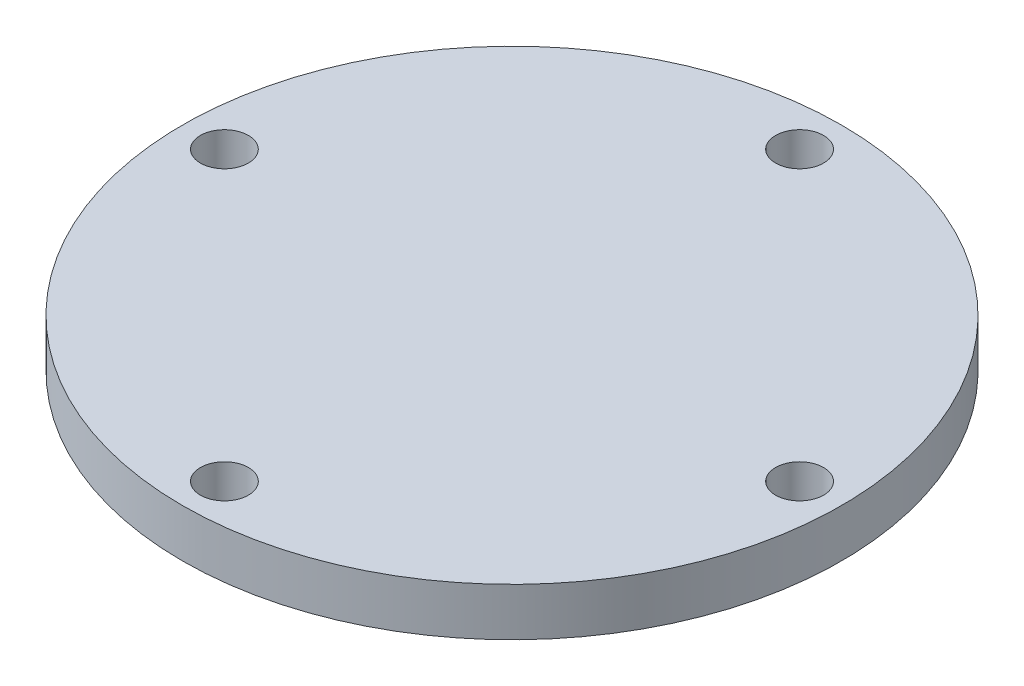
ISO-10303-21;
HEADER;
FILE_DESCRIPTION(('STEP AP214'),'2;1');
FILE_NAME('part.step','',(''),(''),'','','');
FILE_SCHEMA(('AUTOMOTIVE_DESIGN { 1 0 10303 214 1 1 1 1 }'));
ENDSEC;
DATA;
#1=APPLICATION_CONTEXT('core data for automotive mechanical design processes');
#2=APPLICATION_PROTOCOL_DEFINITION('international standard','automotive_design',2000,#1);
#3=PRODUCT_CONTEXT('',#1,'mechanical');
#4=PRODUCT('Part','Part','',(#3));
#5=PRODUCT_RELATED_PRODUCT_CATEGORY('part','',(#4));
#6=PRODUCT_DEFINITION_FORMATION('','',#4);
#7=PRODUCT_DEFINITION_CONTEXT('part definition',#1,'design');
#8=PRODUCT_DEFINITION('design','',#6,#7);
#9=PRODUCT_DEFINITION_SHAPE('','',#8);
#10=(LENGTH_UNIT() NAMED_UNIT(*) SI_UNIT(.MILLI.,.METRE.));
#11=(NAMED_UNIT(*) PLANE_ANGLE_UNIT() SI_UNIT($,.RADIAN.));
#12=(NAMED_UNIT(*) SI_UNIT($,.STERADIAN.) SOLID_ANGLE_UNIT());
#13=UNCERTAINTY_MEASURE_WITH_UNIT(LENGTH_MEASURE(1.E-05),#10,'distance_accuracy_value','');
#14=(GEOMETRIC_REPRESENTATION_CONTEXT(3) GLOBAL_UNCERTAINTY_ASSIGNED_CONTEXT((#13)) GLOBAL_UNIT_ASSIGNED_CONTEXT((#10,
#11,#12)) REPRESENTATION_CONTEXT('',''));
#15=CARTESIAN_POINT('',(0.,0.,0.));
#16=DIRECTION('',(0.,0.,1.));
#17=DIRECTION('',(1.,0.,0.));
#18=AXIS2_PLACEMENT_3D('',#15,#16,#17);
#19=CARTESIAN_POINT('',(0.,4.,0.));
#20=DIRECTION('',(0.,-1.,0.));
#21=DIRECTION('',(0.,0.,-1.));
#22=AXIS2_PLACEMENT_3D('',#19,#20,#21);
#23=CYLINDRICAL_SURFACE('',#22,27.469);
#24=CARTESIAN_POINT('',(0.,4.,0.));
#25=DIRECTION('',(0.,1.,0.));
#26=DIRECTION('',(0.,0.,1.));
#27=AXIS2_PLACEMENT_3D('',#24,#25,#26);
#28=CIRCLE('',#27,27.469);
#29=CARTESIAN_POINT('',(0.,4.,27.469));
#30=VERTEX_POINT('',#29);
#31=EDGE_CURVE('E10',#30,#30,#28,.T.);
#32=ORIENTED_EDGE('',*,*,#31,.F.);
#33=EDGE_LOOP('',(#32));
#34=FACE_BOUND('',#33,.T.);
#35=CARTESIAN_POINT('',(0.,0.,0.));
#36=DIRECTION('',(0.,1.,0.));
#37=DIRECTION('',(0.,0.,1.));
#38=AXIS2_PLACEMENT_3D('',#35,#36,#37);
#39=CIRCLE('',#38,27.469);
#40=CARTESIAN_POINT('',(0.,0.,27.469));
#41=VERTEX_POINT('',#40);
#42=EDGE_CURVE('E34',#41,#41,#39,.T.);
#43=ORIENTED_EDGE('',*,*,#42,.T.);
#44=EDGE_LOOP('',(#43));
#45=FACE_BOUND('',#44,.T.);
#46=ADVANCED_FACE('F31',(#34,#45),#23,.T.);
#47=CARTESIAN_POINT('',(0.,4.,0.));
#48=DIRECTION('',(0.,1.,0.));
#49=DIRECTION('',(0.,0.,1.));
#50=AXIS2_PLACEMENT_3D('',#47,#48,#49);
#51=PLANE('',#50);
#52=CARTESIAN_POINT('',(-23.971,4.,0.));
#53=DIRECTION('',(0.,1.,0.));
#54=DIRECTION('',(0.,0.,1.));
#55=AXIS2_PLACEMENT_3D('',#52,#53,#54);
#56=CIRCLE('',#55,2.);
#57=CARTESIAN_POINT('',(-23.971,4.,2.));
#58=VERTEX_POINT('',#57);
#59=EDGE_CURVE('E61',#58,#58,#56,.T.);
#60=ORIENTED_EDGE('',*,*,#59,.F.);
#61=EDGE_LOOP('',(#60));
#62=FACE_BOUND('',#61,.T.);
#63=CARTESIAN_POINT('',(0.,4.,-23.971));
#64=DIRECTION('',(0.,1.,0.));
#65=DIRECTION('',(0.,0.,1.));
#66=AXIS2_PLACEMENT_3D('',#63,#64,#65);
#67=CIRCLE('',#66,2.);
#68=CARTESIAN_POINT('',(0.,4.,-21.971));
#69=VERTEX_POINT('',#68);
#70=EDGE_CURVE('E55',#69,#69,#67,.T.);
#71=ORIENTED_EDGE('',*,*,#70,.F.);
#72=EDGE_LOOP('',(#71));
#73=FACE_BOUND('',#72,.T.);
#74=CARTESIAN_POINT('',(23.971,4.,0.));
#75=DIRECTION('',(0.,1.,0.));
#76=DIRECTION('',(0.,0.,1.));
#77=AXIS2_PLACEMENT_3D('',#74,#75,#76);
#78=CIRCLE('',#77,2.);
#79=CARTESIAN_POINT('',(23.971,4.,2.));
#80=VERTEX_POINT('',#79);
#81=EDGE_CURVE('E49',#80,#80,#78,.T.);
#82=ORIENTED_EDGE('',*,*,#81,.F.);
#83=EDGE_LOOP('',(#82));
#84=FACE_BOUND('',#83,.T.);
#85=CARTESIAN_POINT('',(0.,4.,23.971));
#86=DIRECTION('',(0.,1.,0.));
#87=DIRECTION('',(0.,0.,1.));
#88=AXIS2_PLACEMENT_3D('',#85,#86,#87);
#89=CIRCLE('',#88,2.);
#90=CARTESIAN_POINT('',(0.,4.,25.971));
#91=VERTEX_POINT('',#90);
#92=EDGE_CURVE('E43',#91,#91,#89,.T.);
#93=ORIENTED_EDGE('',*,*,#92,.F.);
#94=EDGE_LOOP('',(#93));
#95=FACE_BOUND('',#94,.T.);
#96=ORIENTED_EDGE('',*,*,#31,.T.);
#97=EDGE_LOOP('',(#96));
#98=FACE_BOUND('',#97,.T.);
#99=ADVANCED_FACE('F77',(#62,#73,#84,#95,#98),#51,.T.);
#100=CARTESIAN_POINT('',(0.,0.,0.));
#101=DIRECTION('',(0.,1.,0.));
#102=DIRECTION('',(0.,0.,1.));
#103=AXIS2_PLACEMENT_3D('',#100,#101,#102);
#104=PLANE('',#103);
#105=CARTESIAN_POINT('',(-23.971,0.,0.));
#106=DIRECTION('',(0.,1.,0.));
#107=DIRECTION('',(0.,0.,1.));
#108=AXIS2_PLACEMENT_3D('',#105,#106,#107);
#109=CIRCLE('',#108,2.);
#110=CARTESIAN_POINT('',(-23.971,0.,2.));
#111=VERTEX_POINT('',#110);
#112=EDGE_CURVE('E41',#111,#111,#109,.T.);
#113=ORIENTED_EDGE('',*,*,#112,.T.);
#114=EDGE_LOOP('',(#113));
#115=FACE_BOUND('',#114,.T.);
#116=CARTESIAN_POINT('',(0.,0.,-23.971));
#117=DIRECTION('',(0.,1.,0.));
#118=DIRECTION('',(0.,0.,1.));
#119=AXIS2_PLACEMENT_3D('',#116,#117,#118);
#120=CIRCLE('',#119,2.);
#121=CARTESIAN_POINT('',(0.,0.,-21.971));
#122=VERTEX_POINT('',#121);
#123=EDGE_CURVE('E58',#122,#122,#120,.T.);
#124=ORIENTED_EDGE('',*,*,#123,.T.);
#125=EDGE_LOOP('',(#124));
#126=FACE_BOUND('',#125,.T.);
#127=CARTESIAN_POINT('',(23.971,0.,0.));
#128=DIRECTION('',(0.,1.,0.));
#129=DIRECTION('',(0.,0.,1.));
#130=AXIS2_PLACEMENT_3D('',#127,#128,#129);
#131=CIRCLE('',#130,2.);
#132=CARTESIAN_POINT('',(23.971,0.,2.));
#133=VERTEX_POINT('',#132);
#134=EDGE_CURVE('E52',#133,#133,#131,.T.);
#135=ORIENTED_EDGE('',*,*,#134,.T.);
#136=EDGE_LOOP('',(#135));
#137=FACE_BOUND('',#136,.T.);
#138=CARTESIAN_POINT('',(0.,0.,23.971));
#139=DIRECTION('',(0.,1.,0.));
#140=DIRECTION('',(0.,0.,1.));
#141=AXIS2_PLACEMENT_3D('',#138,#139,#140);
#142=CIRCLE('',#141,2.);
#143=CARTESIAN_POINT('',(0.,0.,25.971));
#144=VERTEX_POINT('',#143);
#145=EDGE_CURVE('E46',#144,#144,#142,.T.);
#146=ORIENTED_EDGE('',*,*,#145,.T.);
#147=EDGE_LOOP('',(#146));
#148=FACE_BOUND('',#147,.T.);
#149=ORIENTED_EDGE('',*,*,#42,.F.);
#150=EDGE_LOOP('',(#149));
#151=FACE_BOUND('',#150,.T.);
#152=ADVANCED_FACE('F67',(#115,#126,#137,#148,#151),#104,.F.);
#153=CARTESIAN_POINT('',(0.,0.,23.971));
#154=DIRECTION('',(0.,1.,0.));
#155=DIRECTION('',(0.,0.,1.));
#156=AXIS2_PLACEMENT_3D('',#153,#154,#155);
#157=CYLINDRICAL_SURFACE('',#156,2.);
#158=ORIENTED_EDGE('',*,*,#145,.F.);
#159=EDGE_LOOP('',(#158));
#160=FACE_BOUND('',#159,.T.);
#161=ORIENTED_EDGE('',*,*,#92,.T.);
#162=EDGE_LOOP('',(#161));
#163=FACE_BOUND('',#162,.T.);
#164=ADVANCED_FACE('F87',(#160,#163),#157,.F.);
#165=CARTESIAN_POINT('',(23.971,0.,0.));
#166=DIRECTION('',(0.,1.,0.));
#167=DIRECTION('',(0.,0.,1.));
#168=AXIS2_PLACEMENT_3D('',#165,#166,#167);
#169=CYLINDRICAL_SURFACE('',#168,2.);
#170=ORIENTED_EDGE('',*,*,#134,.F.);
#171=EDGE_LOOP('',(#170));
#172=FACE_BOUND('',#171,.T.);
#173=ORIENTED_EDGE('',*,*,#81,.T.);
#174=EDGE_LOOP('',(#173));
#175=FACE_BOUND('',#174,.T.);
#176=ADVANCED_FACE('F89',(#172,#175),#169,.F.);
#177=CARTESIAN_POINT('',(0.,0.,-23.971));
#178=DIRECTION('',(0.,1.,0.));
#179=DIRECTION('',(0.,0.,1.));
#180=AXIS2_PLACEMENT_3D('',#177,#178,#179);
#181=CYLINDRICAL_SURFACE('',#180,2.);
#182=ORIENTED_EDGE('',*,*,#123,.F.);
#183=EDGE_LOOP('',(#182));
#184=FACE_BOUND('',#183,.T.);
#185=ORIENTED_EDGE('',*,*,#70,.T.);
#186=EDGE_LOOP('',(#185));
#187=FACE_BOUND('',#186,.T.);
#188=ADVANCED_FACE('F73',(#184,#187),#181,.F.);
#189=CARTESIAN_POINT('',(-23.971,0.,0.));
#190=DIRECTION('',(0.,1.,0.));
#191=DIRECTION('',(0.,0.,1.));
#192=AXIS2_PLACEMENT_3D('',#189,#190,#191);
#193=CYLINDRICAL_SURFACE('',#192,2.);
#194=ORIENTED_EDGE('',*,*,#112,.F.);
#195=EDGE_LOOP('',(#194));
#196=FACE_BOUND('',#195,.T.);
#197=ORIENTED_EDGE('',*,*,#59,.T.);
#198=EDGE_LOOP('',(#197));
#199=FACE_BOUND('',#198,.T.);
#200=ADVANCED_FACE('F70',(#196,#199),#193,.F.);
#201=CLOSED_SHELL('',(#46,#99,#152,#164,#176,#188,#200));
#202=MANIFOLD_SOLID_BREP('B2',#201);
#203=ADVANCED_BREP_SHAPE_REPRESENTATION('',(#18,#202),#14);
#204=SHAPE_DEFINITION_REPRESENTATION(#9,#203);
ENDSEC;
END-ISO-10303-21;
